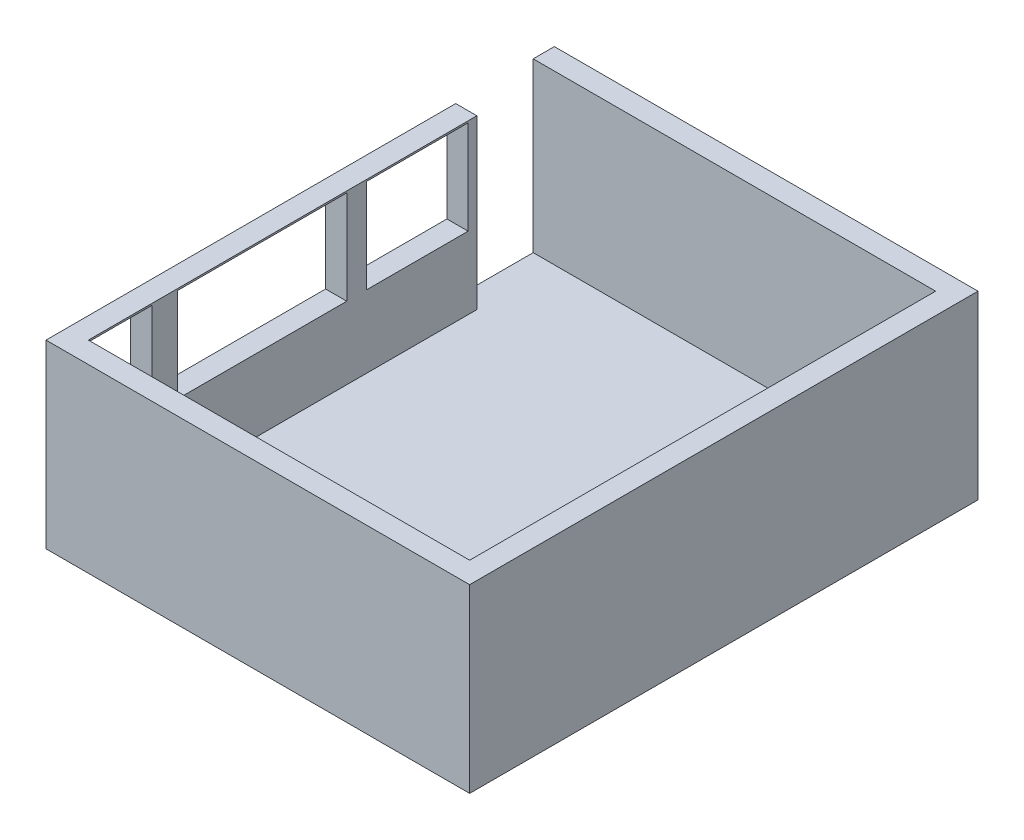
ISO-10303-21;
HEADER;
FILE_DESCRIPTION(('STEP AP214'),'2;1');
FILE_NAME('part.step','',(''),(''),'','','');
FILE_SCHEMA(('AUTOMOTIVE_DESIGN { 1 0 10303 214 1 1 1 1 }'));
ENDSEC;
DATA;
#1=APPLICATION_CONTEXT('core data for automotive mechanical design processes');
#2=APPLICATION_PROTOCOL_DEFINITION('international standard','automotive_design',2000,#1);
#3=PRODUCT_CONTEXT('',#1,'mechanical');
#4=PRODUCT('Part','Part','',(#3));
#5=PRODUCT_RELATED_PRODUCT_CATEGORY('part','',(#4));
#6=PRODUCT_DEFINITION_FORMATION('','',#4);
#7=PRODUCT_DEFINITION_CONTEXT('part definition',#1,'design');
#8=PRODUCT_DEFINITION('design','',#6,#7);
#9=PRODUCT_DEFINITION_SHAPE('','',#8);
#10=(LENGTH_UNIT() NAMED_UNIT(*) SI_UNIT(.MILLI.,.METRE.));
#11=(NAMED_UNIT(*) PLANE_ANGLE_UNIT() SI_UNIT($,.RADIAN.));
#12=(NAMED_UNIT(*) SI_UNIT($,.STERADIAN.) SOLID_ANGLE_UNIT());
#13=UNCERTAINTY_MEASURE_WITH_UNIT(LENGTH_MEASURE(1.E-05),#10,'distance_accuracy_value','');
#14=(GEOMETRIC_REPRESENTATION_CONTEXT(3) GLOBAL_UNCERTAINTY_ASSIGNED_CONTEXT((#13)) GLOBAL_UNIT_ASSIGNED_CONTEXT((#10,
#11,#12)) REPRESENTATION_CONTEXT('',''));
#15=CARTESIAN_POINT('',(0.,0.,0.));
#16=DIRECTION('',(0.,0.,1.));
#17=DIRECTION('',(1.,0.,0.));
#18=AXIS2_PLACEMENT_3D('',#15,#16,#17);
#19=CARTESIAN_POINT('',(0.,0.,0.));
#20=DIRECTION('',(0.,1.,0.));
#21=DIRECTION('',(0.,0.,1.));
#22=AXIS2_PLACEMENT_3D('',#19,#20,#21);
#23=PLANE('',#22);
#24=DIRECTION('',(0.,0.,-1.));
#25=VECTOR('',#24,1.);
#26=CARTESIAN_POINT('',(123.66766227868,0.,0.));
#27=LINE('',#26,#25);
#28=CARTESIAN_POINT('',(123.66766227868,0.,5971.11164005986));
#29=VERTEX_POINT('',#28);
#30=CARTESIAN_POINT('',(123.66766227868,0.,-28.8883599401394));
#31=VERTEX_POINT('',#30);
#32=EDGE_CURVE('E255',#29,#31,#27,.T.);
#33=ORIENTED_EDGE('',*,*,#32,.F.);
#34=DIRECTION('',(1.,0.,0.));
#35=VECTOR('',#34,1.);
#36=CARTESIAN_POINT('',(0.,0.,5971.11164005986));
#37=LINE('',#36,#35);
#38=CARTESIAN_POINT('',(-4876.33233772132,0.,5971.11164005986));
#39=VERTEX_POINT('',#38);
#40=EDGE_CURVE('E269',#39,#29,#37,.T.);
#41=ORIENTED_EDGE('',*,*,#40,.F.);
#42=DIRECTION('',(0.,0.,1.));
#43=VECTOR('',#42,1.);
#44=CARTESIAN_POINT('',(-4876.33233772132,0.,7.21842191608323E-13));
#45=LINE('',#44,#43);
#46=CARTESIAN_POINT('',(-4876.33233772132,0.,-28.8883599401387));
#47=VERTEX_POINT('',#46);
#48=EDGE_CURVE('E287',#47,#39,#45,.T.);
#49=ORIENTED_EDGE('',*,*,#48,.F.);
#50=DIRECTION('',(-1.,0.,0.));
#51=VECTOR('',#50,1.);
#52=CARTESIAN_POINT('',(0.,0.,-28.8883599401393));
#53=LINE('',#52,#51);
#54=EDGE_CURVE('E284',#31,#47,#53,.T.);
#55=ORIENTED_EDGE('',*,*,#54,.F.);
#56=EDGE_LOOP('',(#33,#41,#49,#55));
#57=FACE_BOUND('',#56,.T.);
#58=ADVANCED_FACE('F65',(#57),#23,.F.);
#59=CARTESIAN_POINT('',(0.,2133.6,5971.11164005986));
#60=DIRECTION('',(0.,0.,-1.));
#61=DIRECTION('',(-1.,0.,0.));
#62=AXIS2_PLACEMENT_3D('',#59,#60,#61);
#63=PLANE('',#62);
#64=ORIENTED_EDGE('',*,*,#40,.T.);
#65=DIRECTION('',(0.,-1.,0.));
#66=VECTOR('',#65,1.);
#67=CARTESIAN_POINT('',(123.66766227868,2133.6,5971.11164005986));
#68=LINE('',#67,#66);
#69=CARTESIAN_POINT('',(123.66766227868,2133.6,5971.11164005986));
#70=VERTEX_POINT('',#69);
#71=EDGE_CURVE('E280',#70,#29,#68,.T.);
#72=ORIENTED_EDGE('',*,*,#71,.F.);
#73=DIRECTION('',(1.,0.,0.));
#74=VECTOR('',#73,1.);
#75=CARTESIAN_POINT('',(0.,2133.6,5971.11164005986));
#76=LINE('',#75,#74);
#77=CARTESIAN_POINT('',(-4876.33233772132,2133.6,5971.11164005986));
#78=VERTEX_POINT('',#77);
#79=EDGE_CURVE('E277',#78,#70,#76,.T.);
#80=ORIENTED_EDGE('',*,*,#79,.F.);
#81=DIRECTION('',(0.,-1.,0.));
#82=VECTOR('',#81,1.);
#83=CARTESIAN_POINT('',(-4876.33233772132,2133.6,5971.11164005986));
#84=LINE('',#83,#82);
#85=EDGE_CURVE('E295',#78,#39,#84,.T.);
#86=ORIENTED_EDGE('',*,*,#85,.T.);
#87=EDGE_LOOP('',(#64,#72,#80,#86));
#88=FACE_BOUND('',#87,.T.);
#89=ADVANCED_FACE('F313',(#88),#63,.F.);
#90=CARTESIAN_POINT('',(-4876.33233772132,2133.6,7.21842191608323E-13));
#91=DIRECTION('',(1.,0.,0.));
#92=DIRECTION('',(0.,0.,-1.));
#93=AXIS2_PLACEMENT_3D('',#90,#91,#92);
#94=PLANE('',#93);
#95=DIRECTION('',(0.,1.,0.));
#96=VECTOR('',#95,1.);
#97=CARTESIAN_POINT('',(-4876.33233772132,2113.52182872949,1239.13141627636));
#98=LINE('',#97,#96);
#99=CARTESIAN_POINT('',(-4876.33233772132,1005.84,1239.13141627636));
#100=VERTEX_POINT('',#99);
#101=CARTESIAN_POINT('',(-4876.33233772132,2113.52182872949,1239.13141627636));
#102=VERTEX_POINT('',#101);
#103=EDGE_CURVE('E367',#100,#102,#98,.T.);
#104=ORIENTED_EDGE('',*,*,#103,.T.);
#105=DIRECTION('',(0.,0.,1.));
#106=VECTOR('',#105,1.);
#107=CARTESIAN_POINT('',(-4876.33233772132,2113.52182872949,2439.13141627636));
#108=LINE('',#107,#106);
#109=CARTESIAN_POINT('',(-4876.33233772132,2113.52182872949,2439.13141627636));
#110=VERTEX_POINT('',#109);
#111=EDGE_CURVE('E356',#102,#110,#108,.T.);
#112=ORIENTED_EDGE('',*,*,#111,.T.);
#113=DIRECTION('',(0.,-1.,0.));
#114=VECTOR('',#113,1.);
#115=CARTESIAN_POINT('',(-4876.33233772132,2113.52182872949,2439.13141627636));
#116=LINE('',#115,#114);
#117=CARTESIAN_POINT('',(-4876.33233772132,1005.84,2439.13141627636));
#118=VERTEX_POINT('',#117);
#119=EDGE_CURVE('E360',#110,#118,#116,.T.);
#120=ORIENTED_EDGE('',*,*,#119,.T.);
#121=DIRECTION('',(0.,0.,-1.));
#122=VECTOR('',#121,1.);
#123=CARTESIAN_POINT('',(-4876.33233772132,1005.84,1239.13141627636));
#124=LINE('',#123,#122);
#125=EDGE_CURVE('E89',#118,#100,#124,.T.);
#126=ORIENTED_EDGE('',*,*,#125,.T.);
#127=EDGE_LOOP('',(#104,#112,#120,#126));
#128=FACE_BOUND('',#127,.T.);
#129=DIRECTION('',(0.,1.,0.));
#130=VECTOR('',#129,1.);
#131=CARTESIAN_POINT('',(-4876.33233772132,2113.52182872949,4971.11164005986));
#132=LINE('',#131,#130);
#133=CARTESIAN_POINT('',(-4876.33233772132,1005.84,4971.11164005986));
#134=VERTEX_POINT('',#133);
#135=CARTESIAN_POINT('',(-4876.33233772132,2113.52182872949,4971.11164005986));
#136=VERTEX_POINT('',#135);
#137=EDGE_CURVE('E411',#134,#136,#132,.T.);
#138=ORIENTED_EDGE('',*,*,#137,.T.);
#139=DIRECTION('',(0.,0.,1.));
#140=VECTOR('',#139,1.);
#141=CARTESIAN_POINT('',(-4876.33233772132,2113.52182872949,5721.11164005986));
#142=LINE('',#141,#140);
#143=CARTESIAN_POINT('',(-4876.33233772132,2113.52182872949,5721.11164005986));
#144=VERTEX_POINT('',#143);
#145=EDGE_CURVE('E398',#136,#144,#142,.T.);
#146=ORIENTED_EDGE('',*,*,#145,.T.);
#147=DIRECTION('',(0.,-1.,0.));
#148=VECTOR('',#147,1.);
#149=CARTESIAN_POINT('',(-4876.33233772132,2113.52182872949,5721.11164005986));
#150=LINE('',#149,#148);
#151=CARTESIAN_POINT('',(-4876.33233772132,1005.84,5721.11164005986));
#152=VERTEX_POINT('',#151);
#153=EDGE_CURVE('E402',#144,#152,#150,.T.);
#154=ORIENTED_EDGE('',*,*,#153,.T.);
#155=DIRECTION('',(0.,0.,-1.));
#156=VECTOR('',#155,1.);
#157=CARTESIAN_POINT('',(-4876.33233772132,1005.84,4971.11164005986));
#158=LINE('',#157,#156);
#159=EDGE_CURVE('E407',#152,#134,#158,.T.);
#160=ORIENTED_EDGE('',*,*,#159,.T.);
#161=EDGE_LOOP('',(#138,#146,#154,#160));
#162=FACE_BOUND('',#161,.T.);
#163=DIRECTION('',(0.,1.,0.));
#164=VECTOR('',#163,1.);
#165=CARTESIAN_POINT('',(-4876.33233772132,2113.52182872949,2671.11164005986));
#166=LINE('',#165,#164);
#167=CARTESIAN_POINT('',(-4876.33233772132,1005.84,2671.11164005986));
#168=VERTEX_POINT('',#167);
#169=CARTESIAN_POINT('',(-4876.33233772132,2113.52182872949,2671.11164005986));
#170=VERTEX_POINT('',#169);
#171=EDGE_CURVE('E451',#168,#170,#166,.T.);
#172=ORIENTED_EDGE('',*,*,#171,.T.);
#173=DIRECTION('',(0.,0.,1.));
#174=VECTOR('',#173,1.);
#175=CARTESIAN_POINT('',(-4876.33233772132,2113.52182872949,4671.11164005986));
#176=LINE('',#175,#174);
#177=CARTESIAN_POINT('',(-4876.33233772132,2113.52182872949,4671.11164005986));
#178=VERTEX_POINT('',#177);
#179=EDGE_CURVE('E438',#170,#178,#176,.T.);
#180=ORIENTED_EDGE('',*,*,#179,.T.);
#181=DIRECTION('',(0.,-1.,0.));
#182=VECTOR('',#181,1.);
#183=CARTESIAN_POINT('',(-4876.33233772132,2113.52182872949,4671.11164005986));
#184=LINE('',#183,#182);
#185=CARTESIAN_POINT('',(-4876.33233772132,1005.84,4671.11164005986));
#186=VERTEX_POINT('',#185);
#187=EDGE_CURVE('E442',#178,#186,#184,.T.);
#188=ORIENTED_EDGE('',*,*,#187,.T.);
#189=DIRECTION('',(0.,0.,-1.));
#190=VECTOR('',#189,1.);
#191=CARTESIAN_POINT('',(-4876.33233772132,1005.84,2671.11164005986));
#192=LINE('',#191,#190);
#193=EDGE_CURVE('E447',#186,#168,#192,.T.);
#194=ORIENTED_EDGE('',*,*,#193,.T.);
#195=EDGE_LOOP('',(#172,#180,#188,#194));
#196=FACE_BOUND('',#195,.T.);
#197=DIRECTION('',(0.,0.,1.));
#198=VECTOR('',#197,1.);
#199=CARTESIAN_POINT('',(-4876.33233772132,2133.6,7.21842191608323E-13));
#200=LINE('',#199,#198);
#201=CARTESIAN_POINT('',(-4876.33233772132,2133.6,1135.51164005986));
#202=VERTEX_POINT('',#201);
#203=EDGE_CURVE('E272',#202,#78,#200,.T.);
#204=ORIENTED_EDGE('',*,*,#203,.F.);
#205=DIRECTION('',(0.,1.,0.));
#206=VECTOR('',#205,1.);
#207=CARTESIAN_POINT('',(-4876.33233772132,2133.6,1135.51164005986));
#208=LINE('',#207,#206);
#209=CARTESIAN_POINT('',(-4876.33233772132,152.4,1135.51164005986));
#210=VERTEX_POINT('',#209);
#211=EDGE_CURVE('E216',#210,#202,#208,.T.);
#212=ORIENTED_EDGE('',*,*,#211,.F.);
#213=DIRECTION('',(0.,0.,1.));
#214=VECTOR('',#213,1.);
#215=CARTESIAN_POINT('',(-4876.33233772132,152.4,221.111640059861));
#216=LINE('',#215,#214);
#217=CARTESIAN_POINT('',(-4876.33233772132,152.4,221.111640059861));
#218=VERTEX_POINT('',#217);
#219=EDGE_CURVE('E346',#218,#210,#216,.T.);
#220=ORIENTED_EDGE('',*,*,#219,.F.);
#221=DIRECTION('',(0.,-1.,0.));
#222=VECTOR('',#221,1.);
#223=CARTESIAN_POINT('',(-4876.33233772132,152.4,221.111640059861));
#224=LINE('',#223,#222);
#225=CARTESIAN_POINT('',(-4876.33233772132,2133.6,221.111640059861));
#226=VERTEX_POINT('',#225);
#227=EDGE_CURVE('E343',#226,#218,#224,.T.);
#228=ORIENTED_EDGE('',*,*,#227,.F.);
#229=CARTESIAN_POINT('',(-4876.33233772132,2133.6,-28.8883599401387));
#230=VERTEX_POINT('',#229);
#231=EDGE_CURVE('E273',#230,#226,#200,.T.);
#232=ORIENTED_EDGE('',*,*,#231,.F.);
#233=DIRECTION('',(0.,-1.,0.));
#234=VECTOR('',#233,1.);
#235=CARTESIAN_POINT('',(-4876.33233772132,2133.6,-28.8883599401387));
#236=LINE('',#235,#234);
#237=EDGE_CURVE('E74',#230,#47,#236,.T.);
#238=ORIENTED_EDGE('',*,*,#237,.T.);
#239=ORIENTED_EDGE('',*,*,#48,.T.);
#240=ORIENTED_EDGE('',*,*,#85,.F.);
#241=EDGE_LOOP('',(#204,#212,#220,#228,#232,#238,#239,#240));
#242=FACE_BOUND('',#241,.T.);
#243=ADVANCED_FACE('F304',(#128,#162,#196,#242),#94,.F.);
#244=CARTESIAN_POINT('',(0.,2133.6,-28.8883599401393));
#245=DIRECTION('',(0.,0.,1.));
#246=DIRECTION('',(1.,0.,0.));
#247=AXIS2_PLACEMENT_3D('',#244,#245,#246);
#248=PLANE('',#247);
#249=ORIENTED_EDGE('',*,*,#54,.T.);
#250=ORIENTED_EDGE('',*,*,#237,.F.);
#251=DIRECTION('',(-1.,0.,0.));
#252=VECTOR('',#251,1.);
#253=CARTESIAN_POINT('',(0.,2133.6,-28.8883599401393));
#254=LINE('',#253,#252);
#255=CARTESIAN_POINT('',(123.66766227868,2133.6,-28.8883599401394));
#256=VERTEX_POINT('',#255);
#257=EDGE_CURVE('E268',#256,#230,#254,.T.);
#258=ORIENTED_EDGE('',*,*,#257,.F.);
#259=DIRECTION('',(0.,-1.,0.));
#260=VECTOR('',#259,1.);
#261=CARTESIAN_POINT('',(123.66766227868,2133.6,-28.8883599401394));
#262=LINE('',#261,#260);
#263=EDGE_CURVE('E12',#256,#31,#262,.T.);
#264=ORIENTED_EDGE('',*,*,#263,.T.);
#265=EDGE_LOOP('',(#249,#250,#258,#264));
#266=FACE_BOUND('',#265,.T.);
#267=ADVANCED_FACE('F512',(#266),#248,.F.);
#268=CARTESIAN_POINT('',(123.66766227868,2133.6,0.));
#269=DIRECTION('',(-1.,0.,0.));
#270=DIRECTION('',(0.,0.,1.));
#271=AXIS2_PLACEMENT_3D('',#268,#269,#270);
#272=PLANE('',#271);
#273=ORIENTED_EDGE('',*,*,#32,.T.);
#274=ORIENTED_EDGE('',*,*,#263,.F.);
#275=DIRECTION('',(0.,0.,-1.));
#276=VECTOR('',#275,1.);
#277=CARTESIAN_POINT('',(123.66766227868,2133.6,0.));
#278=LINE('',#277,#276);
#279=EDGE_CURVE('E264',#70,#256,#278,.T.);
#280=ORIENTED_EDGE('',*,*,#279,.F.);
#281=ORIENTED_EDGE('',*,*,#71,.T.);
#282=EDGE_LOOP('',(#273,#274,#280,#281));
#283=FACE_BOUND('',#282,.T.);
#284=ADVANCED_FACE('F67',(#283),#272,.F.);
#285=CARTESIAN_POINT('',(0.,2133.6,0.));
#286=DIRECTION('',(0.,1.,0.));
#287=DIRECTION('',(0.,0.,1.));
#288=AXIS2_PLACEMENT_3D('',#285,#286,#287);
#289=PLANE('',#288);
#290=DIRECTION('',(-1.,0.,0.));
#291=VECTOR('',#290,1.);
#292=CARTESIAN_POINT('',(-4626.33233772132,2133.6,1135.51164005986));
#293=LINE('',#292,#291);
#294=CARTESIAN_POINT('',(-4626.33233772132,2133.6,1135.51164005986));
#295=VERTEX_POINT('',#294);
#296=EDGE_CURVE('E213',#295,#202,#293,.T.);
#297=ORIENTED_EDGE('',*,*,#296,.T.);
#298=ORIENTED_EDGE('',*,*,#203,.T.);
#299=ORIENTED_EDGE('',*,*,#79,.T.);
#300=ORIENTED_EDGE('',*,*,#279,.T.);
#301=ORIENTED_EDGE('',*,*,#257,.T.);
#302=ORIENTED_EDGE('',*,*,#231,.T.);
#303=DIRECTION('',(-1.,0.,0.));
#304=VECTOR('',#303,1.);
#305=CARTESIAN_POINT('',(-4626.33233772132,2133.6,221.111640059861));
#306=LINE('',#305,#304);
#307=CARTESIAN_POINT('',(-126.33233772132,2133.6,221.111640059861));
#308=VERTEX_POINT('',#307);
#309=EDGE_CURVE('E240',#308,#226,#306,.T.);
#310=ORIENTED_EDGE('',*,*,#309,.F.);
#311=DIRECTION('',(0.,0.,-1.));
#312=VECTOR('',#311,1.);
#313=CARTESIAN_POINT('',(-126.33233772132,2133.6,221.111640059861));
#314=LINE('',#313,#312);
#315=CARTESIAN_POINT('',(-126.332337721319,2133.6,5721.11164005986));
#316=VERTEX_POINT('',#315);
#317=EDGE_CURVE('E247',#316,#308,#314,.T.);
#318=ORIENTED_EDGE('',*,*,#317,.F.);
#319=DIRECTION('',(1.,0.,0.));
#320=VECTOR('',#319,1.);
#321=CARTESIAN_POINT('',(-4626.33233772132,2133.6,5721.11164005986));
#322=LINE('',#321,#320);
#323=CARTESIAN_POINT('',(-4626.33233772132,2133.6,5721.11164005986));
#324=VERTEX_POINT('',#323);
#325=EDGE_CURVE('E237',#324,#316,#322,.T.);
#326=ORIENTED_EDGE('',*,*,#325,.F.);
#327=DIRECTION('',(0.,0.,1.));
#328=VECTOR('',#327,1.);
#329=CARTESIAN_POINT('',(-4626.33233772132,2133.6,221.111640059861));
#330=LINE('',#329,#328);
#331=EDGE_CURVE('E228',#295,#324,#330,.T.);
#332=ORIENTED_EDGE('',*,*,#331,.F.);
#333=EDGE_LOOP('',(#297,#298,#299,#300,#301,#302,#310,#318,#326,#332));
#334=FACE_BOUND('',#333,.T.);
#335=ADVANCED_FACE('F235',(#334),#289,.T.);
#336=CARTESIAN_POINT('',(-4626.33233772132,152.4,5721.11164005986));
#337=DIRECTION('',(0.,0.,1.));
#338=DIRECTION('',(1.,0.,0.));
#339=AXIS2_PLACEMENT_3D('',#336,#337,#338);
#340=PLANE('',#339);
#341=ORIENTED_EDGE('',*,*,#325,.T.);
#342=DIRECTION('',(0.,1.,0.));
#343=VECTOR('',#342,1.);
#344=CARTESIAN_POINT('',(-126.332337721319,152.4,5721.11164005986));
#345=LINE('',#344,#343);
#346=CARTESIAN_POINT('',(-126.332337721319,152.4,5721.11164005986));
#347=VERTEX_POINT('',#346);
#348=EDGE_CURVE('E260',#347,#316,#345,.T.);
#349=ORIENTED_EDGE('',*,*,#348,.F.);
#350=DIRECTION('',(1.,0.,0.));
#351=VECTOR('',#350,1.);
#352=CARTESIAN_POINT('',(-4626.33233772132,152.4,5721.11164005986));
#353=LINE('',#352,#351);
#354=CARTESIAN_POINT('',(-4626.33233772132,152.4,5721.11164005986));
#355=VERTEX_POINT('',#354);
#356=EDGE_CURVE('E239',#355,#347,#353,.T.);
#357=ORIENTED_EDGE('',*,*,#356,.F.);
#358=DIRECTION('',(0.,1.,0.));
#359=VECTOR('',#358,1.);
#360=CARTESIAN_POINT('',(-4626.33233772132,152.4,5721.11164005986));
#361=LINE('',#360,#359);
#362=CARTESIAN_POINT('',(-4626.33233772132,1005.84,5721.11164005986));
#363=VERTEX_POINT('',#362);
#364=EDGE_CURVE('E251',#355,#363,#361,.T.);
#365=ORIENTED_EDGE('',*,*,#364,.T.);
#366=DIRECTION('',(1.,0.,0.));
#367=VECTOR('',#366,1.);
#368=CARTESIAN_POINT('',(-4876.33233772132,1005.84,5721.11164005986));
#369=LINE('',#368,#367);
#370=EDGE_CURVE('E432',#152,#363,#369,.T.);
#371=ORIENTED_EDGE('',*,*,#370,.F.);
#372=ORIENTED_EDGE('',*,*,#153,.F.);
#373=DIRECTION('',(1.,0.,0.));
#374=VECTOR('',#373,1.);
#375=CARTESIAN_POINT('',(-4876.33233772132,2113.52182872949,5721.11164005986));
#376=LINE('',#375,#374);
#377=CARTESIAN_POINT('',(-4626.33233772132,2113.52182872949,5721.11164005986));
#378=VERTEX_POINT('',#377);
#379=EDGE_CURVE('E415',#144,#378,#376,.T.);
#380=ORIENTED_EDGE('',*,*,#379,.T.);
#381=EDGE_CURVE('E256',#378,#324,#361,.T.);
#382=ORIENTED_EDGE('',*,*,#381,.T.);
#383=EDGE_LOOP('',(#341,#349,#357,#365,#371,#372,#380,#382));
#384=FACE_BOUND('',#383,.T.);
#385=ADVANCED_FACE('F524',(#384),#340,.F.);
#386=CARTESIAN_POINT('',(-4626.33233772132,152.4,221.111640059861));
#387=DIRECTION('',(-1.,0.,0.));
#388=DIRECTION('',(0.,0.,1.));
#389=AXIS2_PLACEMENT_3D('',#386,#387,#388);
#390=PLANE('',#389);
#391=DIRECTION('',(0.,-1.,0.));
#392=VECTOR('',#391,1.);
#393=CARTESIAN_POINT('',(-4626.33233772132,2113.52182872949,2439.13141627636));
#394=LINE('',#393,#392);
#395=CARTESIAN_POINT('',(-4626.33233772132,2113.52182872949,2439.13141627636));
#396=VERTEX_POINT('',#395);
#397=CARTESIAN_POINT('',(-4626.33233772132,1005.84,2439.13141627636));
#398=VERTEX_POINT('',#397);
#399=EDGE_CURVE('E375',#396,#398,#394,.T.);
#400=ORIENTED_EDGE('',*,*,#399,.F.);
#401=DIRECTION('',(0.,0.,1.));
#402=VECTOR('',#401,1.);
#403=CARTESIAN_POINT('',(-4626.33233772132,2113.52182872949,2439.13141627636));
#404=LINE('',#403,#402);
#405=CARTESIAN_POINT('',(-4626.33233772132,2113.52182872949,1239.13141627636));
#406=VERTEX_POINT('',#405);
#407=EDGE_CURVE('E372',#406,#396,#404,.T.);
#408=ORIENTED_EDGE('',*,*,#407,.F.);
#409=DIRECTION('',(0.,1.,0.));
#410=VECTOR('',#409,1.);
#411=CARTESIAN_POINT('',(-4626.33233772132,2113.52182872949,1239.13141627636));
#412=LINE('',#411,#410);
#413=CARTESIAN_POINT('',(-4626.33233772132,1005.84,1239.13141627636));
#414=VERTEX_POINT('',#413);
#415=EDGE_CURVE('E361',#414,#406,#412,.T.);
#416=ORIENTED_EDGE('',*,*,#415,.F.);
#417=DIRECTION('',(0.,0.,-1.));
#418=VECTOR('',#417,1.);
#419=CARTESIAN_POINT('',(-4626.33233772132,1005.84,1239.13141627636));
#420=LINE('',#419,#418);
#421=EDGE_CURVE('E380',#398,#414,#420,.T.);
#422=ORIENTED_EDGE('',*,*,#421,.F.);
#423=EDGE_LOOP('',(#400,#408,#416,#422));
#424=FACE_BOUND('',#423,.T.);
#425=DIRECTION('',(0.,-1.,0.));
#426=VECTOR('',#425,1.);
#427=CARTESIAN_POINT('',(-4626.33233772132,2113.52182872949,4671.11164005986));
#428=LINE('',#427,#426);
#429=CARTESIAN_POINT('',(-4626.33233772132,2113.52182872949,4671.11164005986));
#430=VERTEX_POINT('',#429);
#431=CARTESIAN_POINT('',(-4626.33233772132,1005.84,4671.11164005986));
#432=VERTEX_POINT('',#431);
#433=EDGE_CURVE('E458',#430,#432,#428,.T.);
#434=ORIENTED_EDGE('',*,*,#433,.F.);
#435=DIRECTION('',(0.,0.,1.));
#436=VECTOR('',#435,1.);
#437=CARTESIAN_POINT('',(-4626.33233772132,2113.52182872949,4671.11164005986));
#438=LINE('',#437,#436);
#439=CARTESIAN_POINT('',(-4626.33233772132,2113.52182872949,2671.11164005986));
#440=VERTEX_POINT('',#439);
#441=EDGE_CURVE('E221',#440,#430,#438,.T.);
#442=ORIENTED_EDGE('',*,*,#441,.F.);
#443=DIRECTION('',(0.,1.,0.));
#444=VECTOR('',#443,1.);
#445=CARTESIAN_POINT('',(-4626.33233772132,2113.52182872949,2671.11164005986));
#446=LINE('',#445,#444);
#447=CARTESIAN_POINT('',(-4626.33233772132,1005.84,2671.11164005986));
#448=VERTEX_POINT('',#447);
#449=EDGE_CURVE('E443',#448,#440,#446,.T.);
#450=ORIENTED_EDGE('',*,*,#449,.F.);
#451=DIRECTION('',(0.,0.,-1.));
#452=VECTOR('',#451,1.);
#453=CARTESIAN_POINT('',(-4626.33233772132,1005.84,2671.11164005986));
#454=LINE('',#453,#452);
#455=EDGE_CURVE('E462',#432,#448,#454,.T.);
#456=ORIENTED_EDGE('',*,*,#455,.F.);
#457=EDGE_LOOP('',(#434,#442,#450,#456));
#458=FACE_BOUND('',#457,.T.);
#459=DIRECTION('',(0.,0.,1.));
#460=VECTOR('',#459,1.);
#461=CARTESIAN_POINT('',(-4626.33233772132,152.4,221.111640059861));
#462=LINE('',#461,#460);
#463=CARTESIAN_POINT('',(-4626.33233772132,152.4,1135.51164005986));
#464=VERTEX_POINT('',#463);
#465=EDGE_CURVE('E231',#464,#355,#462,.T.);
#466=ORIENTED_EDGE('',*,*,#465,.F.);
#467=DIRECTION('',(0.,1.,0.));
#468=VECTOR('',#467,1.);
#469=CARTESIAN_POINT('',(-4626.33233772132,2133.6,1135.51164005986));
#470=LINE('',#469,#468);
#471=EDGE_CURVE('E81',#464,#295,#470,.T.);
#472=ORIENTED_EDGE('',*,*,#471,.T.);
#473=ORIENTED_EDGE('',*,*,#331,.T.);
#474=ORIENTED_EDGE('',*,*,#381,.F.);
#475=DIRECTION('',(0.,0.,1.));
#476=VECTOR('',#475,1.);
#477=CARTESIAN_POINT('',(-4626.33233772132,2113.52182872949,5721.11164005986));
#478=LINE('',#477,#476);
#479=CARTESIAN_POINT('',(-4626.33233772132,2113.52182872949,4971.11164005986));
#480=VERTEX_POINT('',#479);
#481=EDGE_CURVE('E416',#480,#378,#478,.T.);
#482=ORIENTED_EDGE('',*,*,#481,.F.);
#483=DIRECTION('',(0.,1.,0.));
#484=VECTOR('',#483,1.);
#485=CARTESIAN_POINT('',(-4626.33233772132,2113.52182872949,4971.11164005986));
#486=LINE('',#485,#484);
#487=CARTESIAN_POINT('',(-4626.33233772132,1005.84,4971.11164005986));
#488=VERTEX_POINT('',#487);
#489=EDGE_CURVE('E403',#488,#480,#486,.T.);
#490=ORIENTED_EDGE('',*,*,#489,.F.);
#491=DIRECTION('',(0.,0.,-1.));
#492=VECTOR('',#491,1.);
#493=CARTESIAN_POINT('',(-4626.33233772132,1005.84,4971.11164005986));
#494=LINE('',#493,#492);
#495=EDGE_CURVE('E419',#363,#488,#494,.T.);
#496=ORIENTED_EDGE('',*,*,#495,.F.);
#497=ORIENTED_EDGE('',*,*,#364,.F.);
#498=EDGE_LOOP('',(#466,#472,#473,#474,#482,#490,#496,#497));
#499=FACE_BOUND('',#498,.T.);
#500=ADVANCED_FACE('F226',(#424,#458,#499),#390,.F.);
#501=CARTESIAN_POINT('',(-4626.33233772132,152.4,221.111640059861));
#502=DIRECTION('',(0.,0.,-1.));
#503=DIRECTION('',(-1.,0.,0.));
#504=AXIS2_PLACEMENT_3D('',#501,#502,#503);
#505=PLANE('',#504);
#506=ORIENTED_EDGE('',*,*,#309,.T.);
#507=ORIENTED_EDGE('',*,*,#227,.T.);
#508=DIRECTION('',(-1.,0.,0.));
#509=VECTOR('',#508,1.);
#510=CARTESIAN_POINT('',(-4626.33233772132,152.4,221.111640059861));
#511=LINE('',#510,#509);
#512=CARTESIAN_POINT('',(-126.33233772132,152.4,221.111640059861));
#513=VERTEX_POINT('',#512);
#514=EDGE_CURVE('E322',#513,#218,#511,.T.);
#515=ORIENTED_EDGE('',*,*,#514,.F.);
#516=DIRECTION('',(0.,1.,0.));
#517=VECTOR('',#516,1.);
#518=CARTESIAN_POINT('',(-126.33233772132,152.4,221.111640059861));
#519=LINE('',#518,#517);
#520=EDGE_CURVE('E257',#513,#308,#519,.T.);
#521=ORIENTED_EDGE('',*,*,#520,.T.);
#522=EDGE_LOOP('',(#506,#507,#515,#521));
#523=FACE_BOUND('',#522,.T.);
#524=ADVANCED_FACE('F342',(#523),#505,.F.);
#525=CARTESIAN_POINT('',(-126.33233772132,152.4,221.111640059861));
#526=DIRECTION('',(1.,0.,0.));
#527=DIRECTION('',(0.,0.,-1.));
#528=AXIS2_PLACEMENT_3D('',#525,#526,#527);
#529=PLANE('',#528);
#530=ORIENTED_EDGE('',*,*,#317,.T.);
#531=ORIENTED_EDGE('',*,*,#520,.F.);
#532=DIRECTION('',(0.,0.,-1.));
#533=VECTOR('',#532,1.);
#534=CARTESIAN_POINT('',(-126.33233772132,152.4,221.111640059861));
#535=LINE('',#534,#533);
#536=EDGE_CURVE('E245',#347,#513,#535,.T.);
#537=ORIENTED_EDGE('',*,*,#536,.F.);
#538=ORIENTED_EDGE('',*,*,#348,.T.);
#539=EDGE_LOOP('',(#530,#531,#537,#538));
#540=FACE_BOUND('',#539,.T.);
#541=ADVANCED_FACE('F338',(#540),#529,.F.);
#542=CARTESIAN_POINT('',(0.,152.4,0.));
#543=DIRECTION('',(0.,-1.,0.));
#544=DIRECTION('',(0.,0.,-1.));
#545=AXIS2_PLACEMENT_3D('',#542,#543,#544);
#546=PLANE('',#545);
#547=ORIENTED_EDGE('',*,*,#356,.T.);
#548=ORIENTED_EDGE('',*,*,#536,.T.);
#549=ORIENTED_EDGE('',*,*,#514,.T.);
#550=ORIENTED_EDGE('',*,*,#219,.T.);
#551=DIRECTION('',(-1.,0.,0.));
#552=VECTOR('',#551,1.);
#553=CARTESIAN_POINT('',(-4626.33233772132,152.4,1135.51164005986));
#554=LINE('',#553,#552);
#555=EDGE_CURVE('E222',#464,#210,#554,.T.);
#556=ORIENTED_EDGE('',*,*,#555,.F.);
#557=ORIENTED_EDGE('',*,*,#465,.T.);
#558=EDGE_LOOP('',(#547,#548,#549,#550,#556,#557));
#559=FACE_BOUND('',#558,.T.);
#560=ADVANCED_FACE('F503',(#559),#546,.F.);
#561=CARTESIAN_POINT('',(-4876.33233772132,2113.52182872949,4671.11164005986));
#562=DIRECTION('',(0.,1.,0.));
#563=DIRECTION('',(0.,0.,1.));
#564=AXIS2_PLACEMENT_3D('',#561,#562,#563);
#565=PLANE('',#564);
#566=ORIENTED_EDGE('',*,*,#441,.T.);
#567=DIRECTION('',(1.,0.,0.));
#568=VECTOR('',#567,1.);
#569=CARTESIAN_POINT('',(-4876.33233772132,2113.52182872949,4671.11164005986));
#570=LINE('',#569,#568);
#571=EDGE_CURVE('E455',#178,#430,#570,.T.);
#572=ORIENTED_EDGE('',*,*,#571,.F.);
#573=ORIENTED_EDGE('',*,*,#179,.F.);
#574=DIRECTION('',(1.,0.,0.));
#575=VECTOR('',#574,1.);
#576=CARTESIAN_POINT('',(-4876.33233772132,2113.52182872949,2671.11164005986));
#577=LINE('',#576,#575);
#578=EDGE_CURVE('E420',#170,#440,#577,.T.);
#579=ORIENTED_EDGE('',*,*,#578,.T.);
#580=EDGE_LOOP('',(#566,#572,#573,#579));
#581=FACE_BOUND('',#580,.T.);
#582=ADVANCED_FACE('F493',(#581),#565,.F.);
#583=CARTESIAN_POINT('',(-4876.33233772132,2113.52182872949,2671.11164005986));
#584=DIRECTION('',(0.,0.,-1.));
#585=DIRECTION('',(-1.,0.,0.));
#586=AXIS2_PLACEMENT_3D('',#583,#584,#585);
#587=PLANE('',#586);
#588=ORIENTED_EDGE('',*,*,#449,.T.);
#589=ORIENTED_EDGE('',*,*,#578,.F.);
#590=ORIENTED_EDGE('',*,*,#171,.F.);
#591=DIRECTION('',(1.,0.,0.));
#592=VECTOR('',#591,1.);
#593=CARTESIAN_POINT('',(-4876.33233772132,1005.84,2671.11164005986));
#594=LINE('',#593,#592);
#595=EDGE_CURVE('E471',#168,#448,#594,.T.);
#596=ORIENTED_EDGE('',*,*,#595,.T.);
#597=EDGE_LOOP('',(#588,#589,#590,#596));
#598=FACE_BOUND('',#597,.T.);
#599=ADVANCED_FACE('F495',(#598),#587,.F.);
#600=CARTESIAN_POINT('',(-4876.33233772132,1005.84,2671.11164005986));
#601=DIRECTION('',(0.,-1.,0.));
#602=DIRECTION('',(0.,0.,-1.));
#603=AXIS2_PLACEMENT_3D('',#600,#601,#602);
#604=PLANE('',#603);
#605=ORIENTED_EDGE('',*,*,#455,.T.);
#606=ORIENTED_EDGE('',*,*,#595,.F.);
#607=ORIENTED_EDGE('',*,*,#193,.F.);
#608=DIRECTION('',(1.,0.,0.));
#609=VECTOR('',#608,1.);
#610=CARTESIAN_POINT('',(-4876.33233772132,1005.84,4671.11164005986));
#611=LINE('',#610,#609);
#612=EDGE_CURVE('E474',#186,#432,#611,.T.);
#613=ORIENTED_EDGE('',*,*,#612,.T.);
#614=EDGE_LOOP('',(#605,#606,#607,#613));
#615=FACE_BOUND('',#614,.T.);
#616=ADVANCED_FACE('F490',(#615),#604,.F.);
#617=CARTESIAN_POINT('',(-4876.33233772132,2113.52182872949,4671.11164005986));
#618=DIRECTION('',(0.,0.,1.));
#619=DIRECTION('',(1.,0.,0.));
#620=AXIS2_PLACEMENT_3D('',#617,#618,#619);
#621=PLANE('',#620);
#622=ORIENTED_EDGE('',*,*,#433,.T.);
#623=ORIENTED_EDGE('',*,*,#612,.F.);
#624=ORIENTED_EDGE('',*,*,#187,.F.);
#625=ORIENTED_EDGE('',*,*,#571,.T.);
#626=EDGE_LOOP('',(#622,#623,#624,#625));
#627=FACE_BOUND('',#626,.T.);
#628=ADVANCED_FACE('F481',(#627),#621,.F.);
#629=CARTESIAN_POINT('',(-4876.33233772132,2113.52182872949,5721.11164005986));
#630=DIRECTION('',(0.,1.,0.));
#631=DIRECTION('',(0.,0.,1.));
#632=AXIS2_PLACEMENT_3D('',#629,#630,#631);
#633=PLANE('',#632);
#634=ORIENTED_EDGE('',*,*,#481,.T.);
#635=ORIENTED_EDGE('',*,*,#379,.F.);
#636=ORIENTED_EDGE('',*,*,#145,.F.);
#637=DIRECTION('',(1.,0.,0.));
#638=VECTOR('',#637,1.);
#639=CARTESIAN_POINT('',(-4876.33233772132,2113.52182872949,4971.11164005986));
#640=LINE('',#639,#638);
#641=EDGE_CURVE('E376',#136,#480,#640,.T.);
#642=ORIENTED_EDGE('',*,*,#641,.T.);
#643=EDGE_LOOP('',(#634,#635,#636,#642));
#644=FACE_BOUND('',#643,.T.);
#645=ADVANCED_FACE('F541',(#644),#633,.F.);
#646=CARTESIAN_POINT('',(-4876.33233772132,2113.52182872949,4971.11164005986));
#647=DIRECTION('',(0.,0.,-1.));
#648=DIRECTION('',(-1.,0.,0.));
#649=AXIS2_PLACEMENT_3D('',#646,#647,#648);
#650=PLANE('',#649);
#651=ORIENTED_EDGE('',*,*,#489,.T.);
#652=ORIENTED_EDGE('',*,*,#641,.F.);
#653=ORIENTED_EDGE('',*,*,#137,.F.);
#654=DIRECTION('',(1.,0.,0.));
#655=VECTOR('',#654,1.);
#656=CARTESIAN_POINT('',(-4876.33233772132,1005.84,4971.11164005986));
#657=LINE('',#656,#655);
#658=EDGE_CURVE('E429',#134,#488,#657,.T.);
#659=ORIENTED_EDGE('',*,*,#658,.T.);
#660=EDGE_LOOP('',(#651,#652,#653,#659));
#661=FACE_BOUND('',#660,.T.);
#662=ADVANCED_FACE('F545',(#661),#650,.F.);
#663=CARTESIAN_POINT('',(-4876.33233772132,1005.84,4971.11164005986));
#664=DIRECTION('',(0.,-1.,0.));
#665=DIRECTION('',(0.,0.,-1.));
#666=AXIS2_PLACEMENT_3D('',#663,#664,#665);
#667=PLANE('',#666);
#668=ORIENTED_EDGE('',*,*,#495,.T.);
#669=ORIENTED_EDGE('',*,*,#658,.F.);
#670=ORIENTED_EDGE('',*,*,#159,.F.);
#671=ORIENTED_EDGE('',*,*,#370,.T.);
#672=EDGE_LOOP('',(#668,#669,#670,#671));
#673=FACE_BOUND('',#672,.T.);
#674=ADVANCED_FACE('F550',(#673),#667,.F.);
#675=CARTESIAN_POINT('',(-4876.33233772132,2113.52182872949,2439.13141627636));
#676=DIRECTION('',(0.,1.,0.));
#677=DIRECTION('',(0.,0.,1.));
#678=AXIS2_PLACEMENT_3D('',#675,#676,#677);
#679=PLANE('',#678);
#680=ORIENTED_EDGE('',*,*,#407,.T.);
#681=DIRECTION('',(1.,0.,0.));
#682=VECTOR('',#681,1.);
#683=CARTESIAN_POINT('',(-4876.33233772132,2113.52182872949,2439.13141627636));
#684=LINE('',#683,#682);
#685=EDGE_CURVE('E371',#110,#396,#684,.T.);
#686=ORIENTED_EDGE('',*,*,#685,.F.);
#687=ORIENTED_EDGE('',*,*,#111,.F.);
#688=DIRECTION('',(1.,0.,0.));
#689=VECTOR('',#688,1.);
#690=CARTESIAN_POINT('',(-4876.33233772132,2113.52182872949,1239.13141627636));
#691=LINE('',#690,#689);
#692=EDGE_CURVE('E333',#102,#406,#691,.T.);
#693=ORIENTED_EDGE('',*,*,#692,.T.);
#694=EDGE_LOOP('',(#680,#686,#687,#693));
#695=FACE_BOUND('',#694,.T.);
#696=ADVANCED_FACE('F555',(#695),#679,.F.);
#697=CARTESIAN_POINT('',(-4876.33233772132,2113.52182872949,1239.13141627636));
#698=DIRECTION('',(0.,0.,-1.));
#699=DIRECTION('',(0.,1.,0.));
#700=AXIS2_PLACEMENT_3D('',#697,#698,#699);
#701=PLANE('',#700);
#702=ORIENTED_EDGE('',*,*,#415,.T.);
#703=ORIENTED_EDGE('',*,*,#692,.F.);
#704=ORIENTED_EDGE('',*,*,#103,.F.);
#705=DIRECTION('',(1.,0.,0.));
#706=VECTOR('',#705,1.);
#707=CARTESIAN_POINT('',(-4876.33233772132,1005.84,1239.13141627636));
#708=LINE('',#707,#706);
#709=EDGE_CURVE('E389',#100,#414,#708,.T.);
#710=ORIENTED_EDGE('',*,*,#709,.T.);
#711=EDGE_LOOP('',(#702,#703,#704,#710));
#712=FACE_BOUND('',#711,.T.);
#713=ADVANCED_FACE('F560',(#712),#701,.F.);
#714=CARTESIAN_POINT('',(-4876.33233772132,1005.84,1239.13141627636));
#715=DIRECTION('',(0.,-1.,0.));
#716=DIRECTION('',(0.,0.,-1.));
#717=AXIS2_PLACEMENT_3D('',#714,#715,#716);
#718=PLANE('',#717);
#719=ORIENTED_EDGE('',*,*,#421,.T.);
#720=ORIENTED_EDGE('',*,*,#709,.F.);
#721=ORIENTED_EDGE('',*,*,#125,.F.);
#722=DIRECTION('',(1.,0.,0.));
#723=VECTOR('',#722,1.);
#724=CARTESIAN_POINT('',(-4876.33233772132,1005.84,2439.13141627636));
#725=LINE('',#724,#723);
#726=EDGE_CURVE('E392',#118,#398,#725,.T.);
#727=ORIENTED_EDGE('',*,*,#726,.T.);
#728=EDGE_LOOP('',(#719,#720,#721,#727));
#729=FACE_BOUND('',#728,.T.);
#730=ADVANCED_FACE('F565',(#729),#718,.F.);
#731=CARTESIAN_POINT('',(-4876.33233772132,2113.52182872949,2439.13141627636));
#732=DIRECTION('',(0.,0.,1.));
#733=DIRECTION('',(1.,0.,0.));
#734=AXIS2_PLACEMENT_3D('',#731,#732,#733);
#735=PLANE('',#734);
#736=ORIENTED_EDGE('',*,*,#399,.T.);
#737=ORIENTED_EDGE('',*,*,#726,.F.);
#738=ORIENTED_EDGE('',*,*,#119,.F.);
#739=ORIENTED_EDGE('',*,*,#685,.T.);
#740=EDGE_LOOP('',(#736,#737,#738,#739));
#741=FACE_BOUND('',#740,.T.);
#742=ADVANCED_FACE('F562',(#741),#735,.F.);
#743=CARTESIAN_POINT('',(-4626.33233772132,2133.6,1135.51164005986));
#744=DIRECTION('',(0.,0.,1.));
#745=DIRECTION('',(1.,0.,0.));
#746=AXIS2_PLACEMENT_3D('',#743,#744,#745);
#747=PLANE('',#746);
#748=ORIENTED_EDGE('',*,*,#211,.T.);
#749=ORIENTED_EDGE('',*,*,#296,.F.);
#750=ORIENTED_EDGE('',*,*,#471,.F.);
#751=ORIENTED_EDGE('',*,*,#555,.T.);
#752=EDGE_LOOP('',(#748,#749,#750,#751));
#753=FACE_BOUND('',#752,.T.);
#754=ADVANCED_FACE('F214',(#753),#747,.F.);
#755=CLOSED_SHELL('',(#58,#89,#243,#267,#284,#335,#385,#500,#524,#541,#560,#582,#599,#616,#628,
#645,#662,#674,#696,#713,#730,#742,#754));
#756=MANIFOLD_SOLID_BREP('B2',#755);
#757=ADVANCED_BREP_SHAPE_REPRESENTATION('',(#18,#756),#14);
#758=SHAPE_DEFINITION_REPRESENTATION(#9,#757);
ENDSEC;
END-ISO-10303-21;
